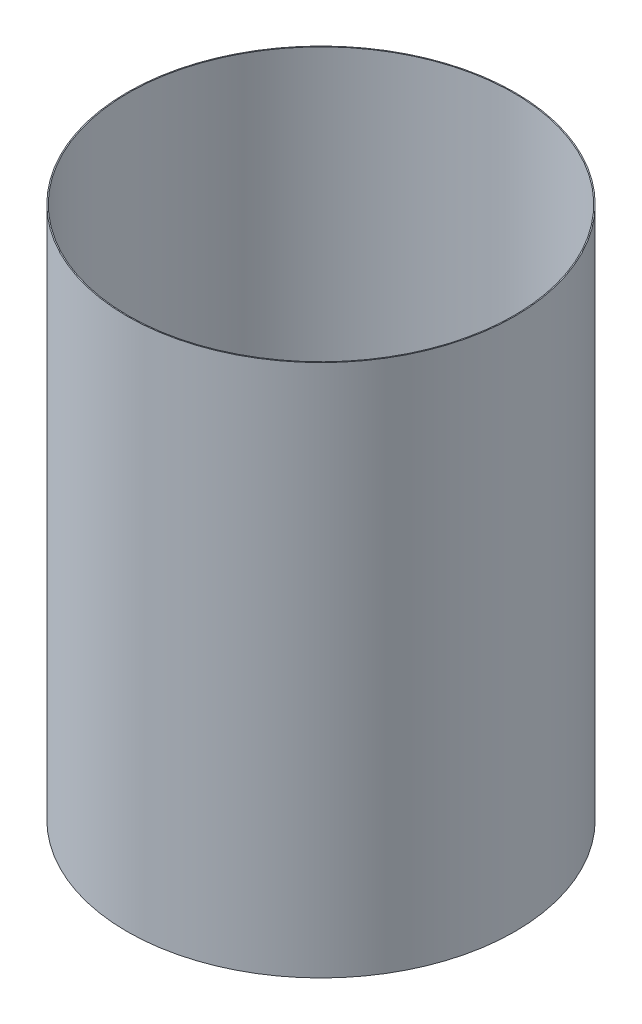
ISO-10303-21;
HEADER;
FILE_DESCRIPTION(('STEP AP214'),'2;1');
FILE_NAME('part.step','',(''),(''),'','','');
FILE_SCHEMA(('AUTOMOTIVE_DESIGN { 1 0 10303 214 1 1 1 1 }'));
ENDSEC;
DATA;
#1=APPLICATION_CONTEXT('core data for automotive mechanical design processes');
#2=APPLICATION_PROTOCOL_DEFINITION('international standard','automotive_design',2000,#1);
#3=PRODUCT_CONTEXT('',#1,'mechanical');
#4=PRODUCT('Part','Part','',(#3));
#5=PRODUCT_RELATED_PRODUCT_CATEGORY('part','',(#4));
#6=PRODUCT_DEFINITION_FORMATION('','',#4);
#7=PRODUCT_DEFINITION_CONTEXT('part definition',#1,'design');
#8=PRODUCT_DEFINITION('design','',#6,#7);
#9=PRODUCT_DEFINITION_SHAPE('','',#8);
#10=(LENGTH_UNIT() NAMED_UNIT(*) SI_UNIT(.MILLI.,.METRE.));
#11=(NAMED_UNIT(*) PLANE_ANGLE_UNIT() SI_UNIT($,.RADIAN.));
#12=(NAMED_UNIT(*) SI_UNIT($,.STERADIAN.) SOLID_ANGLE_UNIT());
#13=UNCERTAINTY_MEASURE_WITH_UNIT(LENGTH_MEASURE(1.E-05),#10,'distance_accuracy_value','');
#14=(GEOMETRIC_REPRESENTATION_CONTEXT(3) GLOBAL_UNCERTAINTY_ASSIGNED_CONTEXT((#13)) GLOBAL_UNIT_ASSIGNED_CONTEXT((#10,
#11,#12)) REPRESENTATION_CONTEXT('',''));
#15=CARTESIAN_POINT('',(0.,0.,0.));
#16=DIRECTION('',(0.,0.,1.));
#17=DIRECTION('',(1.,0.,0.));
#18=AXIS2_PLACEMENT_3D('',#15,#16,#17);
#19=CARTESIAN_POINT('',(0.,55.,0.));
#20=DIRECTION('',(0.,1.,0.));
#21=DIRECTION('',(0.,0.,1.));
#22=AXIS2_PLACEMENT_3D('',#19,#20,#21);
#23=CYLINDRICAL_SURFACE('',#22,48.514);
#24=CARTESIAN_POINT('',(0.,-153.255914232196,0.));
#25=DIRECTION('',(0.,1.,0.));
#26=DIRECTION('',(0.,0.,1.));
#27=AXIS2_PLACEMENT_3D('',#24,#25,#26);
#28=CIRCLE('',#27,48.514);
#29=CARTESIAN_POINT('',(0.,-153.255914232196,48.514));
#30=VERTEX_POINT('',#29);
#31=EDGE_CURVE('E44',#30,#30,#28,.T.);
#32=ORIENTED_EDGE('',*,*,#31,.T.);
#33=EDGE_LOOP('',(#32));
#34=FACE_BOUND('',#33,.T.);
#35=CARTESIAN_POINT('',(0.,-19.905914232196,0.));
#36=DIRECTION('',(0.,1.,0.));
#37=DIRECTION('',(0.,0.,1.));
#38=AXIS2_PLACEMENT_3D('',#35,#36,#37);
#39=CIRCLE('',#38,48.514);
#40=CARTESIAN_POINT('',(0.,-19.905914232196,48.514));
#41=VERTEX_POINT('',#40);
#42=EDGE_CURVE('E10',#41,#41,#39,.T.);
#43=ORIENTED_EDGE('',*,*,#42,.F.);
#44=EDGE_LOOP('',(#43));
#45=FACE_BOUND('',#44,.T.);
#46=ADVANCED_FACE('F30',(#34,#45),#23,.T.);
#47=CARTESIAN_POINT('',(-48.514,-19.905914232196,0.));
#48=DIRECTION('',(0.,-1.,0.));
#49=DIRECTION('',(0.,0.,-1.));
#50=AXIS2_PLACEMENT_3D('',#47,#48,#49);
#51=PLANE('',#50);
#52=CARTESIAN_POINT('',(0.,-19.905914232196,0.));
#53=DIRECTION('',(0.,1.,0.));
#54=DIRECTION('',(0.,0.,1.));
#55=AXIS2_PLACEMENT_3D('',#52,#53,#54);
#56=CIRCLE('',#55,48.26);
#57=CARTESIAN_POINT('',(0.,-19.905914232196,48.26));
#58=VERTEX_POINT('',#57);
#59=EDGE_CURVE('E36',#58,#58,#56,.T.);
#60=ORIENTED_EDGE('',*,*,#59,.F.);
#61=EDGE_LOOP('',(#60));
#62=FACE_BOUND('',#61,.T.);
#63=ORIENTED_EDGE('',*,*,#42,.T.);
#64=EDGE_LOOP('',(#63));
#65=FACE_BOUND('',#64,.T.);
#66=ADVANCED_FACE('F60',(#62,#65),#51,.F.);
#67=CARTESIAN_POINT('',(0.,55.,0.));
#68=DIRECTION('',(0.,1.,0.));
#69=DIRECTION('',(0.,0.,1.));
#70=AXIS2_PLACEMENT_3D('',#67,#68,#69);
#71=CYLINDRICAL_SURFACE('',#70,48.26);
#72=CARTESIAN_POINT('',(0.,-153.255914232196,0.));
#73=DIRECTION('',(0.,1.,0.));
#74=DIRECTION('',(0.,0.,1.));
#75=AXIS2_PLACEMENT_3D('',#72,#73,#74);
#76=CIRCLE('',#75,48.26);
#77=CARTESIAN_POINT('',(0.,-153.255914232196,48.26));
#78=VERTEX_POINT('',#77);
#79=EDGE_CURVE('E40',#78,#78,#76,.T.);
#80=ORIENTED_EDGE('',*,*,#79,.F.);
#81=EDGE_LOOP('',(#80));
#82=FACE_BOUND('',#81,.T.);
#83=ORIENTED_EDGE('',*,*,#59,.T.);
#84=EDGE_LOOP('',(#83));
#85=FACE_BOUND('',#84,.T.);
#86=ADVANCED_FACE('F55',(#82,#85),#71,.F.);
#87=CARTESIAN_POINT('',(-48.26,-153.255914232196,0.));
#88=DIRECTION('',(0.,1.,0.));
#89=DIRECTION('',(0.,0.,1.));
#90=AXIS2_PLACEMENT_3D('',#87,#88,#89);
#91=PLANE('',#90);
#92=ORIENTED_EDGE('',*,*,#31,.F.);
#93=EDGE_LOOP('',(#92));
#94=FACE_BOUND('',#93,.T.);
#95=ORIENTED_EDGE('',*,*,#79,.T.);
#96=EDGE_LOOP('',(#95));
#97=FACE_BOUND('',#96,.T.);
#98=ADVANCED_FACE('F52',(#94,#97),#91,.F.);
#99=CLOSED_SHELL('',(#46,#66,#86,#98));
#100=MANIFOLD_SOLID_BREP('B2',#99);
#101=ADVANCED_BREP_SHAPE_REPRESENTATION('',(#18,#100),#14);
#102=SHAPE_DEFINITION_REPRESENTATION(#9,#101);
ENDSEC;
END-ISO-10303-21;
